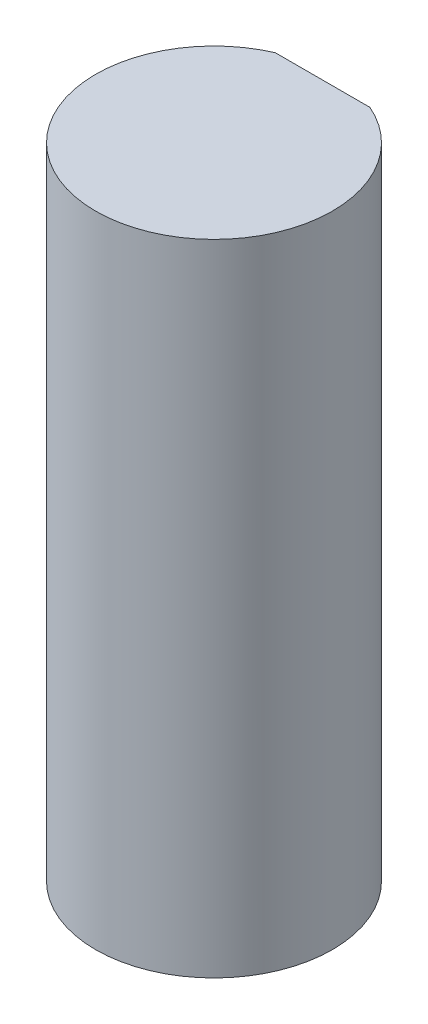
ISO-10303-21;
HEADER;
FILE_DESCRIPTION(('STEP AP214'),'2;1');
FILE_NAME('part.step','',(''),(''),'','','');
FILE_SCHEMA(('AUTOMOTIVE_DESIGN { 1 0 10303 214 1 1 1 1 }'));
ENDSEC;
DATA;
#1=APPLICATION_CONTEXT('core data for automotive mechanical design processes');
#2=APPLICATION_PROTOCOL_DEFINITION('international standard','automotive_design',2000,#1);
#3=PRODUCT_CONTEXT('',#1,'mechanical');
#4=PRODUCT('Part','Part','',(#3));
#5=PRODUCT_RELATED_PRODUCT_CATEGORY('part','',(#4));
#6=PRODUCT_DEFINITION_FORMATION('','',#4);
#7=PRODUCT_DEFINITION_CONTEXT('part definition',#1,'design');
#8=PRODUCT_DEFINITION('design','',#6,#7);
#9=PRODUCT_DEFINITION_SHAPE('','',#8);
#10=(LENGTH_UNIT() NAMED_UNIT(*) SI_UNIT(.MILLI.,.METRE.));
#11=(NAMED_UNIT(*) PLANE_ANGLE_UNIT() SI_UNIT($,.RADIAN.));
#12=(NAMED_UNIT(*) SI_UNIT($,.STERADIAN.) SOLID_ANGLE_UNIT());
#13=UNCERTAINTY_MEASURE_WITH_UNIT(LENGTH_MEASURE(1.E-05),#10,'distance_accuracy_value','');
#14=(GEOMETRIC_REPRESENTATION_CONTEXT(3) GLOBAL_UNCERTAINTY_ASSIGNED_CONTEXT((#13)) GLOBAL_UNIT_ASSIGNED_CONTEXT((#10,
#11,#12)) REPRESENTATION_CONTEXT('',''));
#15=CARTESIAN_POINT('',(0.,0.,0.));
#16=DIRECTION('',(0.,0.,1.));
#17=DIRECTION('',(1.,0.,0.));
#18=AXIS2_PLACEMENT_3D('',#15,#16,#17);
#19=CARTESIAN_POINT('',(0.,16.2,0.));
#20=DIRECTION('',(0.,-1.,0.));
#21=DIRECTION('',(0.,0.,-1.));
#22=AXIS2_PLACEMENT_3D('',#19,#20,#21);
#23=CYLINDRICAL_SURFACE('',#22,3.);
#24=CARTESIAN_POINT('',(0.,16.2,0.));
#25=DIRECTION('',(0.,1.,0.));
#26=DIRECTION('',(0.,0.,1.));
#27=AXIS2_PLACEMENT_3D('',#24,#25,#26);
#28=CIRCLE('',#27,3.);
#29=CARTESIAN_POINT('',(-1.19895788082818,16.2,-2.75));
#30=VERTEX_POINT('',#29);
#31=CARTESIAN_POINT('',(1.19895788082818,16.2,-2.75));
#32=VERTEX_POINT('',#31);
#33=EDGE_CURVE('E11',#30,#32,#28,.T.);
#34=ORIENTED_EDGE('',*,*,#33,.F.);
#35=DIRECTION('',(0.,1.,0.));
#36=VECTOR('',#35,1.);
#37=CARTESIAN_POINT('',(-1.19895788082818,4.2,-2.75));
#38=LINE('',#37,#36);
#39=CARTESIAN_POINT('',(-1.19895788082818,4.2,-2.75));
#40=VERTEX_POINT('',#39);
#41=EDGE_CURVE('E51',#40,#30,#38,.T.);
#42=ORIENTED_EDGE('',*,*,#41,.F.);
#43=CARTESIAN_POINT('',(0.,4.2,0.));
#44=DIRECTION('',(0.,1.,0.));
#45=DIRECTION('',(0.,0.,1.));
#46=AXIS2_PLACEMENT_3D('',#43,#44,#45);
#47=CIRCLE('',#46,3.);
#48=CARTESIAN_POINT('',(1.19895788082818,4.2,-2.75));
#49=VERTEX_POINT('',#48);
#50=EDGE_CURVE('E66',#49,#40,#47,.T.);
#51=ORIENTED_EDGE('',*,*,#50,.F.);
#52=DIRECTION('',(0.,1.,0.));
#53=VECTOR('',#52,1.);
#54=CARTESIAN_POINT('',(1.19895788082818,4.2,-2.75));
#55=LINE('',#54,#53);
#56=EDGE_CURVE('E57',#49,#32,#55,.T.);
#57=ORIENTED_EDGE('',*,*,#56,.T.);
#58=EDGE_LOOP('',(#34,#42,#51,#57));
#59=FACE_BOUND('',#58,.T.);
#60=CARTESIAN_POINT('',(0.,0.,0.));
#61=DIRECTION('',(0.,1.,0.));
#62=DIRECTION('',(0.,0.,1.));
#63=AXIS2_PLACEMENT_3D('',#60,#61,#62);
#64=CIRCLE('',#63,3.);
#65=CARTESIAN_POINT('',(0.,0.,3.));
#66=VERTEX_POINT('',#65);
#67=EDGE_CURVE('E40',#66,#66,#64,.T.);
#68=ORIENTED_EDGE('',*,*,#67,.T.);
#69=EDGE_LOOP('',(#68));
#70=FACE_BOUND('',#69,.T.);
#71=ADVANCED_FACE('F37',(#59,#70),#23,.T.);
#72=CARTESIAN_POINT('',(0.,16.2,0.));
#73=DIRECTION('',(0.,1.,0.));
#74=DIRECTION('',(0.,0.,1.));
#75=AXIS2_PLACEMENT_3D('',#72,#73,#74);
#76=PLANE('',#75);
#77=DIRECTION('',(1.,0.,0.));
#78=VECTOR('',#77,1.);
#79=CARTESIAN_POINT('',(-1.19895788082818,16.2,-2.75));
#80=LINE('',#79,#78);
#81=EDGE_CURVE('E62',#30,#32,#80,.T.);
#82=ORIENTED_EDGE('',*,*,#81,.F.);
#83=ORIENTED_EDGE('',*,*,#33,.T.);
#84=EDGE_LOOP('',(#82,#83));
#85=FACE_BOUND('',#84,.T.);
#86=ADVANCED_FACE('F72',(#85),#76,.T.);
#87=CARTESIAN_POINT('',(0.,0.,0.));
#88=DIRECTION('',(0.,1.,0.));
#89=DIRECTION('',(0.,0.,1.));
#90=AXIS2_PLACEMENT_3D('',#87,#88,#89);
#91=PLANE('',#90);
#92=ORIENTED_EDGE('',*,*,#67,.F.);
#93=EDGE_LOOP('',(#92));
#94=FACE_BOUND('',#93,.T.);
#95=ADVANCED_FACE('F74',(#94),#91,.F.);
#96=CARTESIAN_POINT('',(-1.19895788082818,4.2,-2.75));
#97=DIRECTION('',(0.,0.,1.));
#98=DIRECTION('',(1.,0.,0.));
#99=AXIS2_PLACEMENT_3D('',#96,#97,#98);
#100=PLANE('',#99);
#101=ORIENTED_EDGE('',*,*,#81,.T.);
#102=ORIENTED_EDGE('',*,*,#56,.F.);
#103=DIRECTION('',(1.,0.,0.));
#104=VECTOR('',#103,1.);
#105=CARTESIAN_POINT('',(-1.19895788082818,4.2,-2.75));
#106=LINE('',#105,#104);
#107=EDGE_CURVE('E89',#40,#49,#106,.T.);
#108=ORIENTED_EDGE('',*,*,#107,.F.);
#109=ORIENTED_EDGE('',*,*,#41,.T.);
#110=EDGE_LOOP('',(#101,#102,#108,#109));
#111=FACE_BOUND('',#110,.T.);
#112=ADVANCED_FACE('F63',(#111),#100,.F.);
#113=CARTESIAN_POINT('',(0.,4.2,0.));
#114=DIRECTION('',(0.,1.,0.));
#115=DIRECTION('',(0.,0.,1.));
#116=AXIS2_PLACEMENT_3D('',#113,#114,#115);
#117=PLANE('',#116);
#118=ORIENTED_EDGE('',*,*,#50,.T.);
#119=ORIENTED_EDGE('',*,*,#107,.T.);
#120=EDGE_LOOP('',(#118,#119));
#121=FACE_BOUND('',#120,.T.);
#122=ADVANCED_FACE('F84',(#121),#117,.T.);
#123=CLOSED_SHELL('',(#71,#86,#95,#112,#122));
#124=MANIFOLD_SOLID_BREP('B2',#123);
#125=ADVANCED_BREP_SHAPE_REPRESENTATION('',(#18,#124),#14);
#126=SHAPE_DEFINITION_REPRESENTATION(#9,#125);
ENDSEC;
END-ISO-10303-21;
